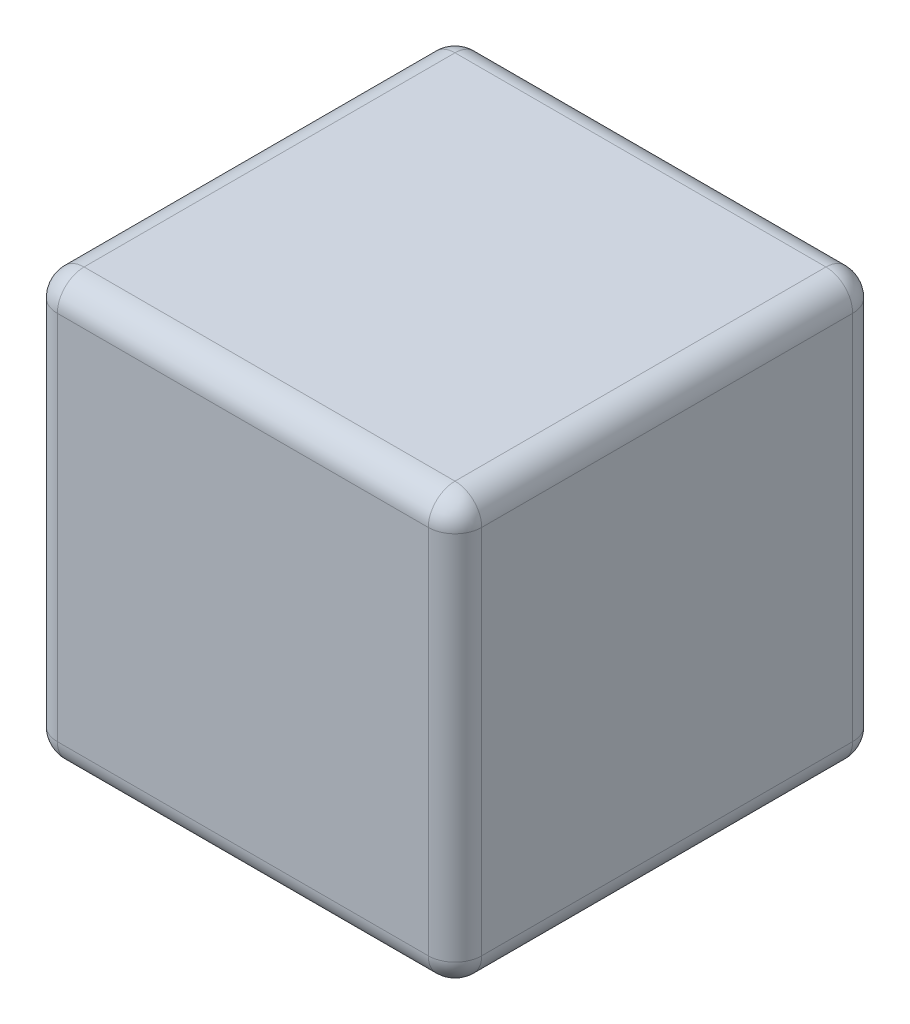
ISO-10303-21;
HEADER;
FILE_DESCRIPTION(('STEP AP214'),'2;1');
FILE_NAME('part.step','',(''),(''),'','','');
FILE_SCHEMA(('AUTOMOTIVE_DESIGN { 1 0 10303 214 1 1 1 1 }'));
ENDSEC;
DATA;
#1=APPLICATION_CONTEXT('core data for automotive mechanical design processes');
#2=APPLICATION_PROTOCOL_DEFINITION('international standard','automotive_design',2000,#1);
#3=PRODUCT_CONTEXT('',#1,'mechanical');
#4=PRODUCT('Part','Part','',(#3));
#5=PRODUCT_RELATED_PRODUCT_CATEGORY('part','',(#4));
#6=PRODUCT_DEFINITION_FORMATION('','',#4);
#7=PRODUCT_DEFINITION_CONTEXT('part definition',#1,'design');
#8=PRODUCT_DEFINITION('design','',#6,#7);
#9=PRODUCT_DEFINITION_SHAPE('','',#8);
#10=(LENGTH_UNIT() NAMED_UNIT(*) SI_UNIT(.MILLI.,.METRE.));
#11=(NAMED_UNIT(*) PLANE_ANGLE_UNIT() SI_UNIT($,.RADIAN.));
#12=(NAMED_UNIT(*) SI_UNIT($,.STERADIAN.) SOLID_ANGLE_UNIT());
#13=UNCERTAINTY_MEASURE_WITH_UNIT(LENGTH_MEASURE(1.E-05),#10,'distance_accuracy_value','');
#14=(GEOMETRIC_REPRESENTATION_CONTEXT(3) GLOBAL_UNCERTAINTY_ASSIGNED_CONTEXT((#13)) GLOBAL_UNIT_ASSIGNED_CONTEXT((#10,
#11,#12)) REPRESENTATION_CONTEXT('',''));
#15=CARTESIAN_POINT('',(0.,0.,0.));
#16=DIRECTION('',(0.,0.,1.));
#17=DIRECTION('',(1.,0.,0.));
#18=AXIS2_PLACEMENT_3D('',#15,#16,#17);
#19=CARTESIAN_POINT('',(0.79375,-0.79375,1.5875));
#20=DIRECTION('',(-1.,0.,0.));
#21=DIRECTION('',(0.,0.,1.));
#22=AXIS2_PLACEMENT_3D('',#19,#20,#21);
#23=PLANE('',#22);
#24=DIRECTION('',(0.,1.,0.));
#25=VECTOR('',#24,1.);
#26=CARTESIAN_POINT('',(0.79375,-0.79375,1.4875));
#27=LINE('',#26,#25);
#28=CARTESIAN_POINT('',(0.79375,0.69375,1.4875));
#29=VERTEX_POINT('',#28);
#30=CARTESIAN_POINT('',(0.79375,-0.69375,1.4875));
#31=VERTEX_POINT('',#30);
#32=EDGE_CURVE('E189',#29,#31,#27,.F.);
#33=ORIENTED_EDGE('',*,*,#32,.T.);
#34=DIRECTION('',(0.,0.,-1.));
#35=VECTOR('',#34,1.);
#36=CARTESIAN_POINT('',(0.79375,-0.69375,1.5875));
#37=LINE('',#36,#35);
#38=CARTESIAN_POINT('',(0.79375,-0.69375,0.1));
#39=VERTEX_POINT('',#38);
#40=EDGE_CURVE('E143',#31,#39,#37,.T.);
#41=ORIENTED_EDGE('',*,*,#40,.T.);
#42=DIRECTION('',(0.,1.,0.));
#43=VECTOR('',#42,1.);
#44=CARTESIAN_POINT('',(0.79375,0.79375,0.1));
#45=LINE('',#44,#43);
#46=CARTESIAN_POINT('',(0.79375,0.69375,0.1));
#47=VERTEX_POINT('',#46);
#48=EDGE_CURVE('E191',#39,#47,#45,.T.);
#49=ORIENTED_EDGE('',*,*,#48,.T.);
#50=DIRECTION('',(0.,0.,-1.));
#51=VECTOR('',#50,1.);
#52=CARTESIAN_POINT('',(0.79375,0.69375,1.5875));
#53=LINE('',#52,#51);
#54=EDGE_CURVE('E187',#47,#29,#53,.F.);
#55=ORIENTED_EDGE('',*,*,#54,.T.);
#56=EDGE_LOOP('',(#33,#41,#49,#55));
#57=FACE_BOUND('',#56,.T.);
#58=ADVANCED_FACE('F37',(#57),#23,.F.);
#59=CARTESIAN_POINT('',(-0.79375,0.79375,1.5875));
#60=DIRECTION('',(0.,-1.,0.));
#61=DIRECTION('',(0.,0.,-1.));
#62=AXIS2_PLACEMENT_3D('',#59,#60,#61);
#63=PLANE('',#62);
#64=DIRECTION('',(-1.,0.,0.));
#65=VECTOR('',#64,1.);
#66=CARTESIAN_POINT('',(-0.79375,0.79375,1.4875));
#67=LINE('',#66,#65);
#68=CARTESIAN_POINT('',(-0.69375,0.79375,1.4875));
#69=VERTEX_POINT('',#68);
#70=CARTESIAN_POINT('',(0.69375,0.79375,1.4875));
#71=VERTEX_POINT('',#70);
#72=EDGE_CURVE('E46',#69,#71,#67,.F.);
#73=ORIENTED_EDGE('',*,*,#72,.T.);
#74=DIRECTION('',(0.,0.,-1.));
#75=VECTOR('',#74,1.);
#76=CARTESIAN_POINT('',(0.69375,0.79375,1.5875));
#77=LINE('',#76,#75);
#78=CARTESIAN_POINT('',(0.69375,0.79375,0.1));
#79=VERTEX_POINT('',#78);
#80=EDGE_CURVE('E11',#71,#79,#77,.T.);
#81=ORIENTED_EDGE('',*,*,#80,.T.);
#82=DIRECTION('',(-1.,0.,0.));
#83=VECTOR('',#82,1.);
#84=CARTESIAN_POINT('',(-0.79375,0.79375,0.1));
#85=LINE('',#84,#83);
#86=CARTESIAN_POINT('',(-0.69375,0.79375,0.1));
#87=VERTEX_POINT('',#86);
#88=EDGE_CURVE('E203',#79,#87,#85,.T.);
#89=ORIENTED_EDGE('',*,*,#88,.T.);
#90=DIRECTION('',(0.,0.,-1.));
#91=VECTOR('',#90,1.);
#92=CARTESIAN_POINT('',(-0.69375,0.79375,1.5875));
#93=LINE('',#92,#91);
#94=EDGE_CURVE('E57',#87,#69,#93,.F.);
#95=ORIENTED_EDGE('',*,*,#94,.T.);
#96=EDGE_LOOP('',(#73,#81,#89,#95));
#97=FACE_BOUND('',#96,.T.);
#98=ADVANCED_FACE('F276',(#97),#63,.F.);
#99=CARTESIAN_POINT('',(-0.79375,-0.79375,1.5875));
#100=DIRECTION('',(1.,0.,0.));
#101=DIRECTION('',(0.,0.,-1.));
#102=AXIS2_PLACEMENT_3D('',#99,#100,#101);
#103=PLANE('',#102);
#104=DIRECTION('',(0.,-1.,0.));
#105=VECTOR('',#104,1.);
#106=CARTESIAN_POINT('',(-0.79375,-0.79375,0.1));
#107=LINE('',#106,#105);
#108=CARTESIAN_POINT('',(-0.79375,0.69375,0.1));
#109=VERTEX_POINT('',#108);
#110=CARTESIAN_POINT('',(-0.79375,-0.69375,0.1));
#111=VERTEX_POINT('',#110);
#112=EDGE_CURVE('E169',#109,#111,#107,.T.);
#113=ORIENTED_EDGE('',*,*,#112,.T.);
#114=DIRECTION('',(0.,0.,-1.));
#115=VECTOR('',#114,1.);
#116=CARTESIAN_POINT('',(-0.79375,-0.69375,1.5875));
#117=LINE('',#116,#115);
#118=CARTESIAN_POINT('',(-0.79375,-0.69375,1.4875));
#119=VERTEX_POINT('',#118);
#120=EDGE_CURVE('E175',#111,#119,#117,.F.);
#121=ORIENTED_EDGE('',*,*,#120,.T.);
#122=DIRECTION('',(0.,-1.,0.));
#123=VECTOR('',#122,1.);
#124=CARTESIAN_POINT('',(-0.79375,-0.79375,1.4875));
#125=LINE('',#124,#123);
#126=CARTESIAN_POINT('',(-0.79375,0.69375,1.4875));
#127=VERTEX_POINT('',#126);
#128=EDGE_CURVE('E173',#119,#127,#125,.F.);
#129=ORIENTED_EDGE('',*,*,#128,.T.);
#130=DIRECTION('',(0.,0.,-1.));
#131=VECTOR('',#130,1.);
#132=CARTESIAN_POINT('',(-0.79375,0.69375,1.5875));
#133=LINE('',#132,#131);
#134=EDGE_CURVE('E171',#127,#109,#133,.T.);
#135=ORIENTED_EDGE('',*,*,#134,.T.);
#136=EDGE_LOOP('',(#113,#121,#129,#135));
#137=FACE_BOUND('',#136,.T.);
#138=ADVANCED_FACE('F336',(#137),#103,.F.);
#139=CARTESIAN_POINT('',(-0.79375,-0.79375,1.5875));
#140=DIRECTION('',(0.,1.,0.));
#141=DIRECTION('',(0.,0.,1.));
#142=AXIS2_PLACEMENT_3D('',#139,#140,#141);
#143=PLANE('',#142);
#144=DIRECTION('',(1.,0.,0.));
#145=VECTOR('',#144,1.);
#146=CARTESIAN_POINT('',(-0.79375,-0.79375,1.4875));
#147=LINE('',#146,#145);
#148=CARTESIAN_POINT('',(0.69375,-0.79375,1.4875));
#149=VERTEX_POINT('',#148);
#150=CARTESIAN_POINT('',(-0.69375,-0.79375,1.4875));
#151=VERTEX_POINT('',#150);
#152=EDGE_CURVE('E129',#149,#151,#147,.F.);
#153=ORIENTED_EDGE('',*,*,#152,.T.);
#154=DIRECTION('',(0.,0.,-1.));
#155=VECTOR('',#154,1.);
#156=CARTESIAN_POINT('',(-0.69375,-0.79375,1.5875));
#157=LINE('',#156,#155);
#158=CARTESIAN_POINT('',(-0.69375,-0.79375,0.1));
#159=VERTEX_POINT('',#158);
#160=EDGE_CURVE('E167',#151,#159,#157,.T.);
#161=ORIENTED_EDGE('',*,*,#160,.T.);
#162=DIRECTION('',(1.,0.,0.));
#163=VECTOR('',#162,1.);
#164=CARTESIAN_POINT('',(0.79375,-0.79375,0.1));
#165=LINE('',#164,#163);
#166=CARTESIAN_POINT('',(0.69375,-0.79375,0.1));
#167=VERTEX_POINT('',#166);
#168=EDGE_CURVE('E132',#159,#167,#165,.T.);
#169=ORIENTED_EDGE('',*,*,#168,.T.);
#170=DIRECTION('',(0.,0.,-1.));
#171=VECTOR('',#170,1.);
#172=CARTESIAN_POINT('',(0.69375,-0.79375,1.5875));
#173=LINE('',#172,#171);
#174=EDGE_CURVE('E124',#167,#149,#173,.F.);
#175=ORIENTED_EDGE('',*,*,#174,.T.);
#176=EDGE_LOOP('',(#153,#161,#169,#175));
#177=FACE_BOUND('',#176,.T.);
#178=ADVANCED_FACE('F126',(#177),#143,.F.);
#179=CARTESIAN_POINT('',(0.,0.,1.5875));
#180=DIRECTION('',(0.,0.,-1.));
#181=DIRECTION('',(-1.,0.,0.));
#182=AXIS2_PLACEMENT_3D('',#179,#180,#181);
#183=PLANE('',#182);
#184=DIRECTION('',(0.,-1.,0.));
#185=VECTOR('',#184,1.);
#186=CARTESIAN_POINT('',(-0.69375,0.,1.5875));
#187=LINE('',#186,#185);
#188=CARTESIAN_POINT('',(-0.69375,0.69375,1.5875));
#189=VERTEX_POINT('',#188);
#190=CARTESIAN_POINT('',(-0.69375,-0.69375,1.5875));
#191=VERTEX_POINT('',#190);
#192=EDGE_CURVE('E198',#189,#191,#187,.T.);
#193=ORIENTED_EDGE('',*,*,#192,.T.);
#194=DIRECTION('',(1.,0.,0.));
#195=VECTOR('',#194,1.);
#196=CARTESIAN_POINT('',(0.,-0.69375,1.5875));
#197=LINE('',#196,#195);
#198=CARTESIAN_POINT('',(0.69375,-0.69375,1.5875));
#199=VERTEX_POINT('',#198);
#200=EDGE_CURVE('E200',#191,#199,#197,.T.);
#201=ORIENTED_EDGE('',*,*,#200,.T.);
#202=DIRECTION('',(0.,1.,0.));
#203=VECTOR('',#202,1.);
#204=CARTESIAN_POINT('',(0.69375,0.,1.5875));
#205=LINE('',#204,#203);
#206=CARTESIAN_POINT('',(0.69375,0.69375,1.5875));
#207=VERTEX_POINT('',#206);
#208=EDGE_CURVE('E196',#199,#207,#205,.T.);
#209=ORIENTED_EDGE('',*,*,#208,.T.);
#210=DIRECTION('',(-1.,0.,0.));
#211=VECTOR('',#210,1.);
#212=CARTESIAN_POINT('',(0.,0.69375,1.5875));
#213=LINE('',#212,#211);
#214=EDGE_CURVE('E194',#207,#189,#213,.T.);
#215=ORIENTED_EDGE('',*,*,#214,.T.);
#216=EDGE_LOOP('',(#193,#201,#209,#215));
#217=FACE_BOUND('',#216,.T.);
#218=ADVANCED_FACE('F301',(#217),#183,.F.);
#219=CARTESIAN_POINT('',(0.,0.,0.));
#220=DIRECTION('',(0.,0.,-1.));
#221=DIRECTION('',(-1.,0.,0.));
#222=AXIS2_PLACEMENT_3D('',#219,#220,#221);
#223=PLANE('',#222);
#224=DIRECTION('',(0.,1.,0.));
#225=VECTOR('',#224,1.);
#226=CARTESIAN_POINT('',(0.69375,-0.79375,0.));
#227=LINE('',#226,#225);
#228=CARTESIAN_POINT('',(0.69375,0.69375,0.));
#229=VERTEX_POINT('',#228);
#230=CARTESIAN_POINT('',(0.69375,-0.69375,0.));
#231=VERTEX_POINT('',#230);
#232=EDGE_CURVE('E182',#229,#231,#227,.F.);
#233=ORIENTED_EDGE('',*,*,#232,.T.);
#234=DIRECTION('',(1.,0.,0.));
#235=VECTOR('',#234,1.);
#236=CARTESIAN_POINT('',(-0.79375,-0.69375,0.));
#237=LINE('',#236,#235);
#238=CARTESIAN_POINT('',(-0.69375,-0.69375,0.));
#239=VERTEX_POINT('',#238);
#240=EDGE_CURVE('E184',#231,#239,#237,.F.);
#241=ORIENTED_EDGE('',*,*,#240,.T.);
#242=DIRECTION('',(0.,-1.,0.));
#243=VECTOR('',#242,1.);
#244=CARTESIAN_POINT('',(-0.69375,0.79375,0.));
#245=LINE('',#244,#243);
#246=CARTESIAN_POINT('',(-0.69375,0.69375,0.));
#247=VERTEX_POINT('',#246);
#248=EDGE_CURVE('E178',#239,#247,#245,.F.);
#249=ORIENTED_EDGE('',*,*,#248,.T.);
#250=DIRECTION('',(-1.,0.,0.));
#251=VECTOR('',#250,1.);
#252=CARTESIAN_POINT('',(0.79375,0.69375,0.));
#253=LINE('',#252,#251);
#254=EDGE_CURVE('E180',#247,#229,#253,.F.);
#255=ORIENTED_EDGE('',*,*,#254,.T.);
#256=EDGE_LOOP('',(#233,#241,#249,#255));
#257=FACE_BOUND('',#256,.T.);
#258=ADVANCED_FACE('F269',(#257),#223,.T.);
#259=CARTESIAN_POINT('',(0.69375,0.69375,1.5875));
#260=DIRECTION('',(0.,0.,-1.));
#261=DIRECTION('',(-1.,0.,0.));
#262=AXIS2_PLACEMENT_3D('',#259,#260,#261);
#263=CYLINDRICAL_SURFACE('',#262,0.1);
#264=CARTESIAN_POINT('',(0.69375,0.69375,1.4875));
#265=DIRECTION('',(0.,0.,1.));
#266=DIRECTION('',(1.,0.,0.));
#267=AXIS2_PLACEMENT_3D('',#264,#265,#266);
#268=CIRCLE('',#267,0.1);
#269=EDGE_CURVE('E41',#29,#71,#268,.T.);
#270=ORIENTED_EDGE('',*,*,#269,.F.);
#271=ORIENTED_EDGE('',*,*,#54,.F.);
#272=CARTESIAN_POINT('',(0.69375,0.69375,0.1));
#273=DIRECTION('',(0.,0.,-1.));
#274=DIRECTION('',(-1.,0.,0.));
#275=AXIS2_PLACEMENT_3D('',#272,#273,#274);
#276=CIRCLE('',#275,0.1);
#277=EDGE_CURVE('E164',#79,#47,#276,.T.);
#278=ORIENTED_EDGE('',*,*,#277,.F.);
#279=ORIENTED_EDGE('',*,*,#80,.F.);
#280=EDGE_LOOP('',(#270,#271,#278,#279));
#281=FACE_BOUND('',#280,.T.);
#282=ADVANCED_FACE('F39',(#281),#263,.T.);
#283=CARTESIAN_POINT('',(0.69375,0.69375,1.4875));
#284=DIRECTION('',(0.,1.,0.));
#285=DIRECTION('',(0.,0.,1.));
#286=AXIS2_PLACEMENT_3D('',#283,#284,#285);
#287=SPHERICAL_SURFACE('',#286,0.1);
#288=CARTESIAN_POINT('',(0.69375,0.69375,1.4875));
#289=DIRECTION('',(0.,1.,0.));
#290=DIRECTION('',(0.,0.,1.));
#291=AXIS2_PLACEMENT_3D('',#288,#289,#290);
#292=CIRCLE('',#291,0.1);
#293=EDGE_CURVE('E249',#29,#207,#292,.F.);
#294=ORIENTED_EDGE('',*,*,#293,.F.);
#295=ORIENTED_EDGE('',*,*,#269,.T.);
#296=CARTESIAN_POINT('',(0.69375,0.69375,1.4875));
#297=DIRECTION('',(1.,0.,0.));
#298=DIRECTION('',(0.,0.,-1.));
#299=AXIS2_PLACEMENT_3D('',#296,#297,#298);
#300=CIRCLE('',#299,0.1);
#301=EDGE_CURVE('E252',#207,#71,#300,.F.);
#302=ORIENTED_EDGE('',*,*,#301,.F.);
#303=EDGE_LOOP('',(#294,#295,#302));
#304=FACE_BOUND('',#303,.T.);
#305=ADVANCED_FACE('F294',(#304),#287,.T.);
#306=CARTESIAN_POINT('',(0.69375,0.69375,0.1));
#307=DIRECTION('',(1.,0.,0.));
#308=DIRECTION('',(0.,0.,-1.));
#309=AXIS2_PLACEMENT_3D('',#306,#307,#308);
#310=SPHERICAL_SURFACE('',#309,0.1);
#311=CARTESIAN_POINT('',(0.69375,0.69375,0.1));
#312=DIRECTION('',(1.,0.,0.));
#313=DIRECTION('',(0.,0.,-1.));
#314=AXIS2_PLACEMENT_3D('',#311,#312,#313);
#315=CIRCLE('',#314,0.1);
#316=EDGE_CURVE('E243',#79,#229,#315,.F.);
#317=ORIENTED_EDGE('',*,*,#316,.F.);
#318=ORIENTED_EDGE('',*,*,#277,.T.);
#319=CARTESIAN_POINT('',(0.69375,0.69375,0.1));
#320=DIRECTION('',(0.,1.,0.));
#321=DIRECTION('',(0.,0.,1.));
#322=AXIS2_PLACEMENT_3D('',#319,#320,#321);
#323=CIRCLE('',#322,0.1);
#324=EDGE_CURVE('E246',#229,#47,#323,.F.);
#325=ORIENTED_EDGE('',*,*,#324,.F.);
#326=EDGE_LOOP('',(#317,#318,#325));
#327=FACE_BOUND('',#326,.T.);
#328=ADVANCED_FACE('F259',(#327),#310,.T.);
#329=CARTESIAN_POINT('',(0.,0.69375,1.4875));
#330=DIRECTION('',(-1.,0.,0.));
#331=DIRECTION('',(0.,0.,1.));
#332=AXIS2_PLACEMENT_3D('',#329,#330,#331);
#333=CYLINDRICAL_SURFACE('',#332,0.1);
#334=ORIENTED_EDGE('',*,*,#301,.T.);
#335=ORIENTED_EDGE('',*,*,#72,.F.);
#336=CARTESIAN_POINT('',(-0.69375,0.69375,1.4875));
#337=DIRECTION('',(-1.,0.,0.));
#338=DIRECTION('',(0.,0.,1.));
#339=AXIS2_PLACEMENT_3D('',#336,#337,#338);
#340=CIRCLE('',#339,0.1);
#341=EDGE_CURVE('E237',#189,#69,#340,.T.);
#342=ORIENTED_EDGE('',*,*,#341,.F.);
#343=ORIENTED_EDGE('',*,*,#214,.F.);
#344=EDGE_LOOP('',(#334,#335,#342,#343));
#345=FACE_BOUND('',#344,.T.);
#346=ADVANCED_FACE('F290',(#345),#333,.T.);
#347=CARTESIAN_POINT('',(0.69375,0.,1.4875));
#348=DIRECTION('',(0.,1.,0.));
#349=DIRECTION('',(0.,0.,1.));
#350=AXIS2_PLACEMENT_3D('',#347,#348,#349);
#351=CYLINDRICAL_SURFACE('',#350,0.1);
#352=ORIENTED_EDGE('',*,*,#293,.T.);
#353=ORIENTED_EDGE('',*,*,#208,.F.);
#354=CARTESIAN_POINT('',(0.69375,-0.69375,1.4875));
#355=DIRECTION('',(0.,-1.,0.));
#356=DIRECTION('',(0.,0.,-1.));
#357=AXIS2_PLACEMENT_3D('',#354,#355,#356);
#358=CIRCLE('',#357,0.1);
#359=EDGE_CURVE('E147',#31,#199,#358,.T.);
#360=ORIENTED_EDGE('',*,*,#359,.F.);
#361=ORIENTED_EDGE('',*,*,#32,.F.);
#362=EDGE_LOOP('',(#352,#353,#360,#361));
#363=FACE_BOUND('',#362,.T.);
#364=ADVANCED_FACE('F299',(#363),#351,.T.);
#365=CARTESIAN_POINT('',(0.69375,-0.69375,1.5875));
#366=DIRECTION('',(0.,0.,-1.));
#367=DIRECTION('',(-1.,0.,0.));
#368=AXIS2_PLACEMENT_3D('',#365,#366,#367);
#369=CYLINDRICAL_SURFACE('',#368,0.1);
#370=CARTESIAN_POINT('',(0.69375,-0.69375,0.1));
#371=DIRECTION('',(0.,0.,-1.));
#372=DIRECTION('',(-1.,0.,0.));
#373=AXIS2_PLACEMENT_3D('',#370,#371,#372);
#374=CIRCLE('',#373,0.1);
#375=EDGE_CURVE('E148',#39,#167,#374,.T.);
#376=ORIENTED_EDGE('',*,*,#375,.F.);
#377=ORIENTED_EDGE('',*,*,#40,.F.);
#378=CARTESIAN_POINT('',(0.69375,-0.69375,1.4875));
#379=DIRECTION('',(0.,0.,1.));
#380=DIRECTION('',(1.,0.,0.));
#381=AXIS2_PLACEMENT_3D('',#378,#379,#380);
#382=CIRCLE('',#381,0.1);
#383=EDGE_CURVE('E139',#149,#31,#382,.T.);
#384=ORIENTED_EDGE('',*,*,#383,.F.);
#385=ORIENTED_EDGE('',*,*,#174,.F.);
#386=EDGE_LOOP('',(#376,#377,#384,#385));
#387=FACE_BOUND('',#386,.T.);
#388=ADVANCED_FACE('F141',(#387),#369,.T.);
#389=CARTESIAN_POINT('',(0.69375,-0.79375,0.1));
#390=DIRECTION('',(0.,-1.,0.));
#391=DIRECTION('',(0.,0.,-1.));
#392=AXIS2_PLACEMENT_3D('',#389,#390,#391);
#393=CYLINDRICAL_SURFACE('',#392,0.1);
#394=ORIENTED_EDGE('',*,*,#324,.T.);
#395=ORIENTED_EDGE('',*,*,#48,.F.);
#396=CARTESIAN_POINT('',(0.69375,-0.69375,0.1));
#397=DIRECTION('',(0.,-1.,0.));
#398=DIRECTION('',(0.,0.,-1.));
#399=AXIS2_PLACEMENT_3D('',#396,#397,#398);
#400=CIRCLE('',#399,0.1);
#401=EDGE_CURVE('E233',#231,#39,#400,.T.);
#402=ORIENTED_EDGE('',*,*,#401,.F.);
#403=ORIENTED_EDGE('',*,*,#232,.F.);
#404=EDGE_LOOP('',(#394,#395,#402,#403));
#405=FACE_BOUND('',#404,.T.);
#406=ADVANCED_FACE('F265',(#405),#393,.T.);
#407=CARTESIAN_POINT('',(-0.79375,0.69375,0.1));
#408=DIRECTION('',(1.,0.,0.));
#409=DIRECTION('',(0.,0.,-1.));
#410=AXIS2_PLACEMENT_3D('',#407,#408,#409);
#411=CYLINDRICAL_SURFACE('',#410,0.1);
#412=ORIENTED_EDGE('',*,*,#316,.T.);
#413=ORIENTED_EDGE('',*,*,#254,.F.);
#414=CARTESIAN_POINT('',(-0.69375,0.69375,0.1));
#415=DIRECTION('',(-1.,0.,0.));
#416=DIRECTION('',(0.,0.,1.));
#417=AXIS2_PLACEMENT_3D('',#414,#415,#416);
#418=CIRCLE('',#417,0.1);
#419=EDGE_CURVE('E230',#87,#247,#418,.T.);
#420=ORIENTED_EDGE('',*,*,#419,.F.);
#421=ORIENTED_EDGE('',*,*,#88,.F.);
#422=EDGE_LOOP('',(#412,#413,#420,#421));
#423=FACE_BOUND('',#422,.T.);
#424=ADVANCED_FACE('F275',(#423),#411,.T.);
#425=CARTESIAN_POINT('',(-0.69375,0.69375,1.5875));
#426=DIRECTION('',(0.,0.,-1.));
#427=DIRECTION('',(-1.,0.,0.));
#428=AXIS2_PLACEMENT_3D('',#425,#426,#427);
#429=CYLINDRICAL_SURFACE('',#428,0.1);
#430=CARTESIAN_POINT('',(-0.69375,0.69375,1.4875));
#431=DIRECTION('',(0.,0.,1.));
#432=DIRECTION('',(1.,0.,0.));
#433=AXIS2_PLACEMENT_3D('',#430,#431,#432);
#434=CIRCLE('',#433,0.1);
#435=EDGE_CURVE('E240',#69,#127,#434,.T.);
#436=ORIENTED_EDGE('',*,*,#435,.F.);
#437=ORIENTED_EDGE('',*,*,#94,.F.);
#438=CARTESIAN_POINT('',(-0.69375,0.69375,0.1));
#439=DIRECTION('',(0.,0.,-1.));
#440=DIRECTION('',(-1.,0.,0.));
#441=AXIS2_PLACEMENT_3D('',#438,#439,#440);
#442=CIRCLE('',#441,0.1);
#443=EDGE_CURVE('E227',#109,#87,#442,.T.);
#444=ORIENTED_EDGE('',*,*,#443,.F.);
#445=ORIENTED_EDGE('',*,*,#134,.F.);
#446=EDGE_LOOP('',(#436,#437,#444,#445));
#447=FACE_BOUND('',#446,.T.);
#448=ADVANCED_FACE('F280',(#447),#429,.T.);
#449=CARTESIAN_POINT('',(-0.69375,0.69375,1.4875));
#450=DIRECTION('',(0.,1.,0.));
#451=DIRECTION('',(0.,0.,1.));
#452=AXIS2_PLACEMENT_3D('',#449,#450,#451);
#453=SPHERICAL_SURFACE('',#452,0.1);
#454=ORIENTED_EDGE('',*,*,#341,.T.);
#455=ORIENTED_EDGE('',*,*,#435,.T.);
#456=CARTESIAN_POINT('',(-0.69375,0.69375,1.4875));
#457=DIRECTION('',(0.,1.,0.));
#458=DIRECTION('',(0.,0.,1.));
#459=AXIS2_PLACEMENT_3D('',#456,#457,#458);
#460=CIRCLE('',#459,0.1);
#461=EDGE_CURVE('E155',#189,#127,#460,.F.);
#462=ORIENTED_EDGE('',*,*,#461,.F.);
#463=EDGE_LOOP('',(#454,#455,#462));
#464=FACE_BOUND('',#463,.T.);
#465=ADVANCED_FACE('F286',(#464),#453,.T.);
#466=CARTESIAN_POINT('',(0.69375,-0.69375,1.4875));
#467=DIRECTION('',(1.,0.,0.));
#468=DIRECTION('',(0.,0.,-1.));
#469=AXIS2_PLACEMENT_3D('',#466,#467,#468);
#470=SPHERICAL_SURFACE('',#469,0.1);
#471=ORIENTED_EDGE('',*,*,#383,.T.);
#472=ORIENTED_EDGE('',*,*,#359,.T.);
#473=CARTESIAN_POINT('',(0.69375,-0.69375,1.4875));
#474=DIRECTION('',(1.,0.,0.));
#475=DIRECTION('',(0.,0.,-1.));
#476=AXIS2_PLACEMENT_3D('',#473,#474,#475);
#477=CIRCLE('',#476,0.1);
#478=EDGE_CURVE('E150',#149,#199,#477,.F.);
#479=ORIENTED_EDGE('',*,*,#478,.F.);
#480=EDGE_LOOP('',(#471,#472,#479));
#481=FACE_BOUND('',#480,.T.);
#482=ADVANCED_FACE('F151',(#481),#470,.T.);
#483=CARTESIAN_POINT('',(0.69375,-0.69375,0.1));
#484=DIRECTION('',(1.,0.,0.));
#485=DIRECTION('',(0.,0.,-1.));
#486=AXIS2_PLACEMENT_3D('',#483,#484,#485);
#487=SPHERICAL_SURFACE('',#486,0.1);
#488=ORIENTED_EDGE('',*,*,#401,.T.);
#489=ORIENTED_EDGE('',*,*,#375,.T.);
#490=CARTESIAN_POINT('',(0.69375,-0.69375,0.1));
#491=DIRECTION('',(1.,0.,0.));
#492=DIRECTION('',(0.,0.,-1.));
#493=AXIS2_PLACEMENT_3D('',#490,#491,#492);
#494=CIRCLE('',#493,0.1);
#495=EDGE_CURVE('E156',#231,#167,#494,.F.);
#496=ORIENTED_EDGE('',*,*,#495,.F.);
#497=EDGE_LOOP('',(#488,#489,#496));
#498=FACE_BOUND('',#497,.T.);
#499=ADVANCED_FACE('F320',(#498),#487,.T.);
#500=CARTESIAN_POINT('',(-0.69375,0.69375,0.1));
#501=DIRECTION('',(0.,1.,0.));
#502=DIRECTION('',(0.,0.,1.));
#503=AXIS2_PLACEMENT_3D('',#500,#501,#502);
#504=SPHERICAL_SURFACE('',#503,0.1);
#505=ORIENTED_EDGE('',*,*,#443,.T.);
#506=ORIENTED_EDGE('',*,*,#419,.T.);
#507=CARTESIAN_POINT('',(-0.69375,0.69375,0.1));
#508=DIRECTION('',(0.,1.,0.));
#509=DIRECTION('',(0.,0.,1.));
#510=AXIS2_PLACEMENT_3D('',#507,#508,#509);
#511=CIRCLE('',#510,0.1);
#512=EDGE_CURVE('E220',#109,#247,#511,.F.);
#513=ORIENTED_EDGE('',*,*,#512,.F.);
#514=EDGE_LOOP('',(#505,#506,#513));
#515=FACE_BOUND('',#514,.T.);
#516=ADVANCED_FACE('F322',(#515),#504,.T.);
#517=CARTESIAN_POINT('',(-0.69375,0.,1.4875));
#518=DIRECTION('',(0.,-1.,0.));
#519=DIRECTION('',(0.,0.,-1.));
#520=AXIS2_PLACEMENT_3D('',#517,#518,#519);
#521=CYLINDRICAL_SURFACE('',#520,0.1);
#522=ORIENTED_EDGE('',*,*,#461,.T.);
#523=ORIENTED_EDGE('',*,*,#128,.F.);
#524=CARTESIAN_POINT('',(-0.69375,-0.69375,1.4875));
#525=DIRECTION('',(0.,-1.,0.));
#526=DIRECTION('',(0.,0.,-1.));
#527=AXIS2_PLACEMENT_3D('',#524,#525,#526);
#528=CIRCLE('',#527,0.1);
#529=EDGE_CURVE('E217',#191,#119,#528,.T.);
#530=ORIENTED_EDGE('',*,*,#529,.F.);
#531=ORIENTED_EDGE('',*,*,#192,.F.);
#532=EDGE_LOOP('',(#522,#523,#530,#531));
#533=FACE_BOUND('',#532,.T.);
#534=ADVANCED_FACE('F305',(#533),#521,.T.);
#535=CARTESIAN_POINT('',(0.,-0.69375,1.4875));
#536=DIRECTION('',(1.,0.,0.));
#537=DIRECTION('',(0.,0.,-1.));
#538=AXIS2_PLACEMENT_3D('',#535,#536,#537);
#539=CYLINDRICAL_SURFACE('',#538,0.1);
#540=ORIENTED_EDGE('',*,*,#478,.T.);
#541=ORIENTED_EDGE('',*,*,#200,.F.);
#542=CARTESIAN_POINT('',(-0.69375,-0.69375,1.4875));
#543=DIRECTION('',(-1.,0.,0.));
#544=DIRECTION('',(0.,0.,1.));
#545=AXIS2_PLACEMENT_3D('',#542,#543,#544);
#546=CIRCLE('',#545,0.1);
#547=EDGE_CURVE('E160',#151,#191,#546,.T.);
#548=ORIENTED_EDGE('',*,*,#547,.F.);
#549=ORIENTED_EDGE('',*,*,#152,.F.);
#550=EDGE_LOOP('',(#540,#541,#548,#549));
#551=FACE_BOUND('',#550,.T.);
#552=ADVANCED_FACE('F158',(#551),#539,.T.);
#553=CARTESIAN_POINT('',(-0.79375,-0.69375,0.1));
#554=DIRECTION('',(-1.,0.,0.));
#555=DIRECTION('',(0.,0.,1.));
#556=AXIS2_PLACEMENT_3D('',#553,#554,#555);
#557=CYLINDRICAL_SURFACE('',#556,0.1);
#558=ORIENTED_EDGE('',*,*,#495,.T.);
#559=ORIENTED_EDGE('',*,*,#168,.F.);
#560=CARTESIAN_POINT('',(-0.69375,-0.69375,0.1));
#561=DIRECTION('',(-1.,0.,0.));
#562=DIRECTION('',(0.,0.,1.));
#563=AXIS2_PLACEMENT_3D('',#560,#561,#562);
#564=CIRCLE('',#563,0.1);
#565=EDGE_CURVE('E213',#239,#159,#564,.T.);
#566=ORIENTED_EDGE('',*,*,#565,.F.);
#567=ORIENTED_EDGE('',*,*,#240,.F.);
#568=EDGE_LOOP('',(#558,#559,#566,#567));
#569=FACE_BOUND('',#568,.T.);
#570=ADVANCED_FACE('F318',(#569),#557,.T.);
#571=CARTESIAN_POINT('',(-0.69375,-0.79375,0.1));
#572=DIRECTION('',(0.,1.,0.));
#573=DIRECTION('',(0.,0.,1.));
#574=AXIS2_PLACEMENT_3D('',#571,#572,#573);
#575=CYLINDRICAL_SURFACE('',#574,0.1);
#576=ORIENTED_EDGE('',*,*,#512,.T.);
#577=ORIENTED_EDGE('',*,*,#248,.F.);
#578=CARTESIAN_POINT('',(-0.69375,-0.69375,0.1));
#579=DIRECTION('',(0.,-1.,0.));
#580=DIRECTION('',(0.,0.,-1.));
#581=AXIS2_PLACEMENT_3D('',#578,#579,#580);
#582=CIRCLE('',#581,0.1);
#583=EDGE_CURVE('E211',#111,#239,#582,.T.);
#584=ORIENTED_EDGE('',*,*,#583,.F.);
#585=ORIENTED_EDGE('',*,*,#112,.F.);
#586=EDGE_LOOP('',(#576,#577,#584,#585));
#587=FACE_BOUND('',#586,.T.);
#588=ADVANCED_FACE('F346',(#587),#575,.T.);
#589=CARTESIAN_POINT('',(-0.69375,-0.69375,1.4875));
#590=DIRECTION('',(0.,0.,1.));
#591=DIRECTION('',(1.,0.,0.));
#592=AXIS2_PLACEMENT_3D('',#589,#590,#591);
#593=SPHERICAL_SURFACE('',#592,0.1);
#594=ORIENTED_EDGE('',*,*,#547,.T.);
#595=ORIENTED_EDGE('',*,*,#529,.T.);
#596=CARTESIAN_POINT('',(-0.69375,-0.69375,1.4875));
#597=DIRECTION('',(0.,0.,1.));
#598=DIRECTION('',(1.,0.,0.));
#599=AXIS2_PLACEMENT_3D('',#596,#597,#598);
#600=CIRCLE('',#599,0.1);
#601=EDGE_CURVE('E209',#151,#119,#600,.F.);
#602=ORIENTED_EDGE('',*,*,#601,.F.);
#603=EDGE_LOOP('',(#594,#595,#602));
#604=FACE_BOUND('',#603,.T.);
#605=ADVANCED_FACE('F307',(#604),#593,.T.);
#606=CARTESIAN_POINT('',(-0.69375,-0.69375,0.1));
#607=DIRECTION('',(0.,0.,-1.));
#608=DIRECTION('',(-1.,0.,0.));
#609=AXIS2_PLACEMENT_3D('',#606,#607,#608);
#610=SPHERICAL_SURFACE('',#609,0.1);
#611=ORIENTED_EDGE('',*,*,#583,.T.);
#612=ORIENTED_EDGE('',*,*,#565,.T.);
#613=CARTESIAN_POINT('',(-0.69375,-0.69375,0.1));
#614=DIRECTION('',(0.,0.,-1.));
#615=DIRECTION('',(-1.,0.,0.));
#616=AXIS2_PLACEMENT_3D('',#613,#614,#615);
#617=CIRCLE('',#616,0.1);
#618=EDGE_CURVE('E207',#111,#159,#617,.F.);
#619=ORIENTED_EDGE('',*,*,#618,.F.);
#620=EDGE_LOOP('',(#611,#612,#619));
#621=FACE_BOUND('',#620,.T.);
#622=ADVANCED_FACE('F315',(#621),#610,.T.);
#623=CARTESIAN_POINT('',(-0.69375,-0.69375,1.5875));
#624=DIRECTION('',(0.,0.,-1.));
#625=DIRECTION('',(-1.,0.,0.));
#626=AXIS2_PLACEMENT_3D('',#623,#624,#625);
#627=CYLINDRICAL_SURFACE('',#626,0.1);
#628=ORIENTED_EDGE('',*,*,#601,.T.);
#629=ORIENTED_EDGE('',*,*,#120,.F.);
#630=ORIENTED_EDGE('',*,*,#618,.T.);
#631=ORIENTED_EDGE('',*,*,#160,.F.);
#632=EDGE_LOOP('',(#628,#629,#630,#631));
#633=FACE_BOUND('',#632,.T.);
#634=ADVANCED_FACE('F311',(#633),#627,.T.);
#635=CLOSED_SHELL('',(#58,#98,#138,#178,#218,#258,#282,#305,#328,#346,#364,#388,#406,#424,#448,
#465,#482,#499,#516,#534,#552,#570,#588,#605,#622,#634));
#636=MANIFOLD_SOLID_BREP('B2',#635);
#637=ADVANCED_BREP_SHAPE_REPRESENTATION('',(#18,#636),#14);
#638=SHAPE_DEFINITION_REPRESENTATION(#9,#637);
ENDSEC;
END-ISO-10303-21;
